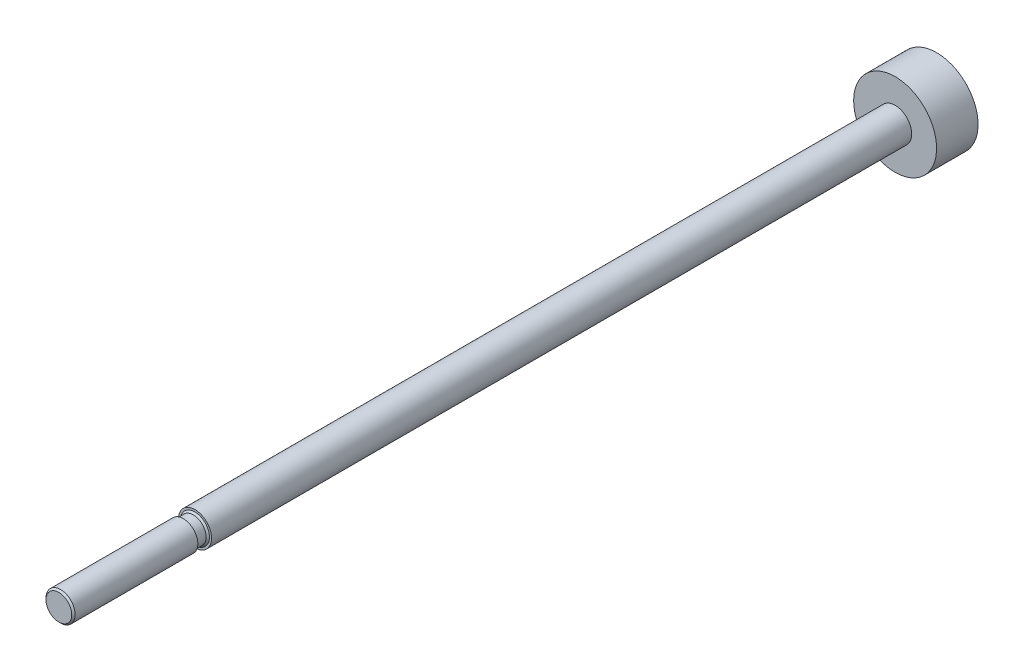
ISO-10303-21;
HEADER;
FILE_DESCRIPTION(('STEP AP214'),'2;1');
FILE_NAME('part.step','',(''),(''),'','','');
FILE_SCHEMA(('AUTOMOTIVE_DESIGN { 1 0 10303 214 1 1 1 1 }'));
ENDSEC;
DATA;
#1=APPLICATION_CONTEXT('core data for automotive mechanical design processes');
#2=APPLICATION_PROTOCOL_DEFINITION('international standard','automotive_design',2000,#1);
#3=PRODUCT_CONTEXT('',#1,'mechanical');
#4=PRODUCT('Part','Part','',(#3));
#5=PRODUCT_RELATED_PRODUCT_CATEGORY('part','',(#4));
#6=PRODUCT_DEFINITION_FORMATION('','',#4);
#7=PRODUCT_DEFINITION_CONTEXT('part definition',#1,'design');
#8=PRODUCT_DEFINITION('design','',#6,#7);
#9=PRODUCT_DEFINITION_SHAPE('','',#8);
#10=(LENGTH_UNIT() NAMED_UNIT(*) SI_UNIT(.MILLI.,.METRE.));
#11=(NAMED_UNIT(*) PLANE_ANGLE_UNIT() SI_UNIT($,.RADIAN.));
#12=(NAMED_UNIT(*) SI_UNIT($,.STERADIAN.) SOLID_ANGLE_UNIT());
#13=UNCERTAINTY_MEASURE_WITH_UNIT(LENGTH_MEASURE(1.E-05),#10,'distance_accuracy_value','');
#14=(GEOMETRIC_REPRESENTATION_CONTEXT(3) GLOBAL_UNCERTAINTY_ASSIGNED_CONTEXT((#13)) GLOBAL_UNIT_ASSIGNED_CONTEXT((#10,
#11,#12)) REPRESENTATION_CONTEXT('',''));
#15=CARTESIAN_POINT('',(0.,0.,0.));
#16=DIRECTION('',(0.,0.,1.));
#17=DIRECTION('',(1.,0.,0.));
#18=AXIS2_PLACEMENT_3D('',#15,#16,#17);
#19=CARTESIAN_POINT('',(0.,0.,103.3));
#20=DIRECTION('',(0.,0.,-1.));
#21=DIRECTION('',(-1.,0.,0.));
#22=AXIS2_PLACEMENT_3D('',#19,#20,#21);
#23=PLANE('',#22);
#24=CARTESIAN_POINT('',(0.,0.,103.300000000047));
#25=DIRECTION('',(0.,0.,-1.));
#26=DIRECTION('',(0.,1.,0.));
#27=AXIS2_PLACEMENT_3D('',#24,#25,#26);
#28=CIRCLE('',#27,1.55250000000251);
#29=CARTESIAN_POINT('',(0.,1.55250000000251,103.300000000047));
#30=VERTEX_POINT('',#29);
#31=EDGE_CURVE('E18',#30,#30,#28,.T.);
#32=ORIENTED_EDGE('',*,*,#31,.F.);
#33=EDGE_LOOP('',(#32));
#34=FACE_BOUND('',#33,.T.);
#35=ADVANCED_FACE('F15',(#34),#23,.F.);
#36=CARTESIAN_POINT('',(0.,0.,103.099999999984));
#37=DIRECTION('',(0.,0.,-1.));
#38=DIRECTION('',(0.,1.,0.));
#39=AXIS2_PLACEMENT_3D('',#36,#37,#38);
#40=CONICAL_SURFACE('',#39,1.75250000000915,0.78539816325534);
#41=CARTESIAN_POINT('',(0.,0.,103.1));
#42=DIRECTION('',(0.,0.,-1.));
#43=DIRECTION('',(-1.,0.,0.));
#44=AXIS2_PLACEMENT_3D('',#41,#42,#43);
#45=CIRCLE('',#44,1.75249999999999);
#46=CARTESIAN_POINT('',(-1.75249999999999,0.,103.1));
#47=VERTEX_POINT('',#46);
#48=EDGE_CURVE('E30',#47,#47,#45,.T.);
#49=ORIENTED_EDGE('',*,*,#48,.F.);
#50=EDGE_LOOP('',(#49));
#51=FACE_BOUND('',#50,.T.);
#52=ORIENTED_EDGE('',*,*,#31,.T.);
#53=EDGE_LOOP('',(#52));
#54=FACE_BOUND('',#53,.T.);
#55=ADVANCED_FACE('F54',(#51,#54),#40,.T.);
#56=CARTESIAN_POINT('',(0.,0.,0.));
#57=DIRECTION('',(0.,0.,-1.));
#58=DIRECTION('',(-1.,0.,0.));
#59=AXIS2_PLACEMENT_3D('',#56,#57,#58);
#60=CYLINDRICAL_SURFACE('',#59,1.75249999999999);
#61=CARTESIAN_POINT('',(0.,0.,88.3));
#62=DIRECTION('',(0.,0.,-1.));
#63=DIRECTION('',(-1.,0.,0.));
#64=AXIS2_PLACEMENT_3D('',#61,#62,#63);
#65=CIRCLE('',#64,1.75249999999999);
#66=CARTESIAN_POINT('',(-1.75249999999999,0.,88.3));
#67=VERTEX_POINT('',#66);
#68=EDGE_CURVE('E44',#67,#67,#65,.F.);
#69=ORIENTED_EDGE('',*,*,#68,.T.);
#70=EDGE_LOOP('',(#69));
#71=FACE_BOUND('',#70,.T.);
#72=ORIENTED_EDGE('',*,*,#48,.T.);
#73=EDGE_LOOP('',(#72));
#74=FACE_BOUND('',#73,.T.);
#75=ADVANCED_FACE('F61',(#71,#74),#60,.T.);
#76=CARTESIAN_POINT('',(0.,1.75249999999999,88.3));
#77=DIRECTION('',(0.,0.,1.));
#78=DIRECTION('',(1.,0.,0.));
#79=AXIS2_PLACEMENT_3D('',#76,#77,#78);
#80=PLANE('',#79);
#81=ORIENTED_EDGE('',*,*,#68,.F.);
#82=EDGE_LOOP('',(#81));
#83=FACE_BOUND('',#82,.T.);
#84=CARTESIAN_POINT('',(0.,0.,88.3));
#85=DIRECTION('',(0.,0.,-1.));
#86=DIRECTION('',(-1.,0.,0.));
#87=AXIS2_PLACEMENT_3D('',#84,#85,#86);
#88=CIRCLE('',#87,1.54999999999999);
#89=CARTESIAN_POINT('',(-1.54999999999999,0.,88.3));
#90=VERTEX_POINT('',#89);
#91=EDGE_CURVE('E42',#90,#90,#88,.T.);
#92=ORIENTED_EDGE('',*,*,#91,.F.);
#93=EDGE_LOOP('',(#92));
#94=FACE_BOUND('',#93,.T.);
#95=ADVANCED_FACE('F93',(#83,#94),#80,.F.);
#96=CARTESIAN_POINT('',(0.,0.,0.));
#97=DIRECTION('',(0.,0.,-1.));
#98=DIRECTION('',(-1.,0.,0.));
#99=AXIS2_PLACEMENT_3D('',#96,#97,#98);
#100=CYLINDRICAL_SURFACE('',#99,1.54999999999999);
#101=CARTESIAN_POINT('',(0.,0.,87.099999999964));
#102=DIRECTION('',(0.,0.,-1.));
#103=DIRECTION('',(-1.,0.,0.));
#104=AXIS2_PLACEMENT_3D('',#101,#102,#103);
#105=CIRCLE('',#104,1.55000000006567);
#106=CARTESIAN_POINT('',(-1.55000000006567,0.,87.099999999964));
#107=VERTEX_POINT('',#106);
#108=EDGE_CURVE('E41',#107,#107,#105,.T.);
#109=ORIENTED_EDGE('',*,*,#108,.F.);
#110=EDGE_LOOP('',(#109));
#111=FACE_BOUND('',#110,.T.);
#112=ORIENTED_EDGE('',*,*,#91,.T.);
#113=EDGE_LOOP('',(#112));
#114=FACE_BOUND('',#113,.T.);
#115=ADVANCED_FACE('F89',(#111,#114),#100,.T.);
#116=CARTESIAN_POINT('',(0.,0.,-2.5));
#117=DIRECTION('',(0.,0.,1.));
#118=DIRECTION('',(1.,0.,0.));
#119=AXIS2_PLACEMENT_3D('',#116,#117,#118);
#120=PLANE('',#119);
#121=CARTESIAN_POINT('',(0.,0.,-2.5));
#122=DIRECTION('',(0.,0.,-1.));
#123=DIRECTION('',(-1.,0.,0.));
#124=AXIS2_PLACEMENT_3D('',#121,#122,#123);
#125=CIRCLE('',#124,5.);
#126=CARTESIAN_POINT('',(-5.,0.,-2.5));
#127=VERTEX_POINT('',#126);
#128=EDGE_CURVE('E38',#127,#127,#125,.F.);
#129=ORIENTED_EDGE('',*,*,#128,.F.);
#130=EDGE_LOOP('',(#129));
#131=FACE_BOUND('',#130,.T.);
#132=ADVANCED_FACE('F85',(#131),#120,.F.);
#133=CARTESIAN_POINT('',(0.,0.,86.9000000000142));
#134=DIRECTION('',(0.,0.,-1.));
#135=DIRECTION('',(-1.,0.,0.));
#136=AXIS2_PLACEMENT_3D('',#133,#134,#135);
#137=CONICAL_SURFACE('',#136,1.75000000001546,0.785398163397448);
#138=CARTESIAN_POINT('',(0.,0.,86.9000000000142));
#139=DIRECTION('',(0.,0.,-1.));
#140=DIRECTION('',(-1.,0.,0.));
#141=AXIS2_PLACEMENT_3D('',#138,#139,#140);
#142=CIRCLE('',#141,1.75000000001546);
#143=CARTESIAN_POINT('',(-1.75000000001546,0.,86.9000000000142));
#144=VERTEX_POINT('',#143);
#145=EDGE_CURVE('E35',#144,#144,#142,.F.);
#146=ORIENTED_EDGE('',*,*,#145,.T.);
#147=EDGE_LOOP('',(#146));
#148=FACE_BOUND('',#147,.T.);
#149=ORIENTED_EDGE('',*,*,#108,.T.);
#150=EDGE_LOOP('',(#149));
#151=FACE_BOUND('',#150,.T.);
#152=ADVANCED_FACE('F81',(#148,#151),#137,.T.);
#153=CARTESIAN_POINT('',(0.,0.,2.5));
#154=DIRECTION('',(0.,0.,-1.));
#155=DIRECTION('',(-1.,0.,0.));
#156=AXIS2_PLACEMENT_3D('',#153,#154,#155);
#157=CYLINDRICAL_SURFACE('',#156,5.);
#158=ORIENTED_EDGE('',*,*,#128,.T.);
#159=EDGE_LOOP('',(#158));
#160=FACE_BOUND('',#159,.T.);
#161=CARTESIAN_POINT('',(0.,0.,2.5));
#162=DIRECTION('',(0.,0.,-1.));
#163=DIRECTION('',(-1.,0.,0.));
#164=AXIS2_PLACEMENT_3D('',#161,#162,#163);
#165=CIRCLE('',#164,5.);
#166=CARTESIAN_POINT('',(-5.,0.,2.5));
#167=VERTEX_POINT('',#166);
#168=EDGE_CURVE('E27',#167,#167,#165,.F.);
#169=ORIENTED_EDGE('',*,*,#168,.F.);
#170=EDGE_LOOP('',(#169));
#171=FACE_BOUND('',#170,.T.);
#172=ADVANCED_FACE('F77',(#160,#171),#157,.T.);
#173=CARTESIAN_POINT('',(0.,1.75,86.9));
#174=DIRECTION('',(0.,0.,-1.));
#175=DIRECTION('',(-1.,0.,0.));
#176=AXIS2_PLACEMENT_3D('',#173,#174,#175);
#177=PLANE('',#176);
#178=CARTESIAN_POINT('',(0.,0.,86.9));
#179=DIRECTION('',(0.,0.,-1.));
#180=DIRECTION('',(-1.,0.,0.));
#181=AXIS2_PLACEMENT_3D('',#178,#179,#180);
#182=CIRCLE('',#181,2.);
#183=CARTESIAN_POINT('',(-2.,0.,86.9));
#184=VERTEX_POINT('',#183);
#185=EDGE_CURVE('E22',#184,#184,#182,.T.);
#186=ORIENTED_EDGE('',*,*,#185,.F.);
#187=EDGE_LOOP('',(#186));
#188=FACE_BOUND('',#187,.T.);
#189=ORIENTED_EDGE('',*,*,#145,.F.);
#190=EDGE_LOOP('',(#189));
#191=FACE_BOUND('',#190,.T.);
#192=ADVANCED_FACE('F70',(#188,#191),#177,.F.);
#193=CARTESIAN_POINT('',(0.,0.,2.5));
#194=DIRECTION('',(0.,0.,1.));
#195=DIRECTION('',(1.,0.,0.));
#196=AXIS2_PLACEMENT_3D('',#193,#194,#195);
#197=PLANE('',#196);
#198=CARTESIAN_POINT('',(0.,0.,2.5));
#199=DIRECTION('',(0.,0.,-1.));
#200=DIRECTION('',(-1.,0.,0.));
#201=AXIS2_PLACEMENT_3D('',#198,#199,#200);
#202=CIRCLE('',#201,2.);
#203=CARTESIAN_POINT('',(-2.,0.,2.5));
#204=VERTEX_POINT('',#203);
#205=EDGE_CURVE('E10',#204,#204,#202,.F.);
#206=ORIENTED_EDGE('',*,*,#205,.F.);
#207=EDGE_LOOP('',(#206));
#208=FACE_BOUND('',#207,.T.);
#209=ORIENTED_EDGE('',*,*,#168,.T.);
#210=EDGE_LOOP('',(#209));
#211=FACE_BOUND('',#210,.T.);
#212=ADVANCED_FACE('F65',(#208,#211),#197,.T.);
#213=CARTESIAN_POINT('',(0.,0.,108.956854249492));
#214=DIRECTION('',(0.,0.,-1.));
#215=DIRECTION('',(-1.,0.,0.));
#216=AXIS2_PLACEMENT_3D('',#213,#214,#215);
#217=CYLINDRICAL_SURFACE('',#216,2.);
#218=ORIENTED_EDGE('',*,*,#205,.T.);
#219=EDGE_LOOP('',(#218));
#220=FACE_BOUND('',#219,.T.);
#221=ORIENTED_EDGE('',*,*,#185,.T.);
#222=EDGE_LOOP('',(#221));
#223=FACE_BOUND('',#222,.T.);
#224=ADVANCED_FACE('F63',(#220,#223),#217,.T.);
#225=CLOSED_SHELL('',(#35,#55,#75,#95,#115,#132,#152,#172,#192,#212,#224));
#226=MANIFOLD_SOLID_BREP('B1',#225);
#227=ADVANCED_BREP_SHAPE_REPRESENTATION('',(#18,#226),#14);
#228=SHAPE_DEFINITION_REPRESENTATION(#9,#227);
ENDSEC;
END-ISO-10303-21;
